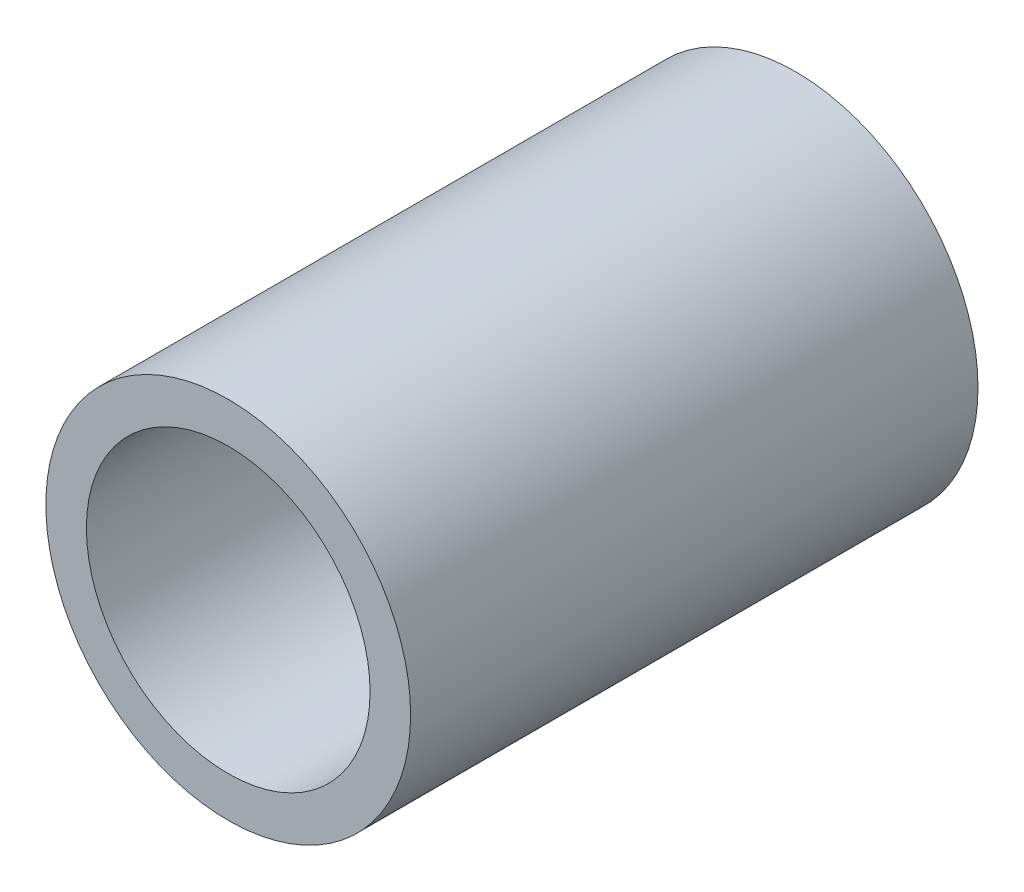
ISO-10303-21;
HEADER;
FILE_DESCRIPTION(('STEP AP214'),'2;1');
FILE_NAME('part.step','',(''),(''),'','','');
FILE_SCHEMA(('AUTOMOTIVE_DESIGN { 1 0 10303 214 1 1 1 1 }'));
ENDSEC;
DATA;
#1=APPLICATION_CONTEXT('core data for automotive mechanical design processes');
#2=APPLICATION_PROTOCOL_DEFINITION('international standard','automotive_design',2000,#1);
#3=PRODUCT_CONTEXT('',#1,'mechanical');
#4=PRODUCT('Part','Part','',(#3));
#5=PRODUCT_RELATED_PRODUCT_CATEGORY('part','',(#4));
#6=PRODUCT_DEFINITION_FORMATION('','',#4);
#7=PRODUCT_DEFINITION_CONTEXT('part definition',#1,'design');
#8=PRODUCT_DEFINITION('design','',#6,#7);
#9=PRODUCT_DEFINITION_SHAPE('','',#8);
#10=(LENGTH_UNIT() NAMED_UNIT(*) SI_UNIT(.MILLI.,.METRE.));
#11=(NAMED_UNIT(*) PLANE_ANGLE_UNIT() SI_UNIT($,.RADIAN.));
#12=(NAMED_UNIT(*) SI_UNIT($,.STERADIAN.) SOLID_ANGLE_UNIT());
#13=UNCERTAINTY_MEASURE_WITH_UNIT(LENGTH_MEASURE(1.E-05),#10,'distance_accuracy_value','');
#14=(GEOMETRIC_REPRESENTATION_CONTEXT(3) GLOBAL_UNCERTAINTY_ASSIGNED_CONTEXT((#13)) GLOBAL_UNIT_ASSIGNED_CONTEXT((#10,
#11,#12)) REPRESENTATION_CONTEXT('',''));
#15=CARTESIAN_POINT('',(0.,0.,0.));
#16=DIRECTION('',(0.,0.,1.));
#17=DIRECTION('',(1.,0.,0.));
#18=AXIS2_PLACEMENT_3D('',#15,#16,#17);
#19=CARTESIAN_POINT('',(0.,0.,7.));
#20=DIRECTION('',(0.,0.,1.));
#21=DIRECTION('',(1.,0.,0.));
#22=AXIS2_PLACEMENT_3D('',#19,#20,#21);
#23=PLANE('',#22);
#24=CARTESIAN_POINT('',(0.,0.,7.));
#25=DIRECTION('',(0.,0.,1.));
#26=DIRECTION('',(1.,0.,0.));
#27=AXIS2_PLACEMENT_3D('',#24,#25,#26);
#28=CIRCLE('',#27,2.25);
#29=CARTESIAN_POINT('',(2.25,0.,7.));
#30=VERTEX_POINT('',#29);
#31=EDGE_CURVE('E10',#30,#30,#28,.T.);
#32=ORIENTED_EDGE('',*,*,#31,.T.);
#33=EDGE_LOOP('',(#32));
#34=FACE_BOUND('',#33,.T.);
#35=CARTESIAN_POINT('',(0.,0.,7.));
#36=DIRECTION('',(0.,0.,1.));
#37=DIRECTION('',(1.,0.,0.));
#38=AXIS2_PLACEMENT_3D('',#35,#36,#37);
#39=CIRCLE('',#38,1.75);
#40=CARTESIAN_POINT('',(1.75,0.,7.));
#41=VERTEX_POINT('',#40);
#42=EDGE_CURVE('E42',#41,#41,#39,.T.);
#43=ORIENTED_EDGE('',*,*,#42,.F.);
#44=EDGE_LOOP('',(#43));
#45=FACE_BOUND('',#44,.T.);
#46=ADVANCED_FACE('F31',(#34,#45),#23,.T.);
#47=CARTESIAN_POINT('',(0.,0.,0.));
#48=DIRECTION('',(0.,0.,1.));
#49=DIRECTION('',(1.,0.,0.));
#50=AXIS2_PLACEMENT_3D('',#47,#48,#49);
#51=PLANE('',#50);
#52=CARTESIAN_POINT('',(0.,0.,0.));
#53=DIRECTION('',(0.,0.,1.));
#54=DIRECTION('',(1.,0.,0.));
#55=AXIS2_PLACEMENT_3D('',#52,#53,#54);
#56=CIRCLE('',#55,2.25);
#57=CARTESIAN_POINT('',(2.25,0.,0.));
#58=VERTEX_POINT('',#57);
#59=EDGE_CURVE('E35',#58,#58,#56,.T.);
#60=ORIENTED_EDGE('',*,*,#59,.F.);
#61=EDGE_LOOP('',(#60));
#62=FACE_BOUND('',#61,.T.);
#63=CARTESIAN_POINT('',(0.,0.,0.));
#64=DIRECTION('',(0.,0.,1.));
#65=DIRECTION('',(1.,0.,0.));
#66=AXIS2_PLACEMENT_3D('',#63,#64,#65);
#67=CIRCLE('',#66,1.75);
#68=CARTESIAN_POINT('',(1.75,0.,0.));
#69=VERTEX_POINT('',#68);
#70=EDGE_CURVE('E44',#69,#69,#67,.T.);
#71=ORIENTED_EDGE('',*,*,#70,.T.);
#72=EDGE_LOOP('',(#71));
#73=FACE_BOUND('',#72,.T.);
#74=ADVANCED_FACE('F54',(#62,#73),#51,.F.);
#75=CARTESIAN_POINT('',(0.,0.,7.));
#76=DIRECTION('',(0.,0.,-1.));
#77=DIRECTION('',(-1.,0.,0.));
#78=AXIS2_PLACEMENT_3D('',#75,#76,#77);
#79=CYLINDRICAL_SURFACE('',#78,2.25);
#80=ORIENTED_EDGE('',*,*,#31,.F.);
#81=EDGE_LOOP('',(#80));
#82=FACE_BOUND('',#81,.T.);
#83=ORIENTED_EDGE('',*,*,#59,.T.);
#84=EDGE_LOOP('',(#83));
#85=FACE_BOUND('',#84,.T.);
#86=ADVANCED_FACE('F33',(#82,#85),#79,.T.);
#87=CARTESIAN_POINT('',(0.,0.,7.));
#88=DIRECTION('',(0.,0.,-1.));
#89=DIRECTION('',(-1.,0.,0.));
#90=AXIS2_PLACEMENT_3D('',#87,#88,#89);
#91=CYLINDRICAL_SURFACE('',#90,1.75);
#92=ORIENTED_EDGE('',*,*,#42,.T.);
#93=EDGE_LOOP('',(#92));
#94=FACE_BOUND('',#93,.T.);
#95=ORIENTED_EDGE('',*,*,#70,.F.);
#96=EDGE_LOOP('',(#95));
#97=FACE_BOUND('',#96,.T.);
#98=ADVANCED_FACE('F50',(#94,#97),#91,.F.);
#99=CLOSED_SHELL('',(#46,#74,#86,#98));
#100=MANIFOLD_SOLID_BREP('B2',#99);
#101=ADVANCED_BREP_SHAPE_REPRESENTATION('',(#18,#100),#14);
#102=SHAPE_DEFINITION_REPRESENTATION(#9,#101);
ENDSEC;
END-ISO-10303-21;
